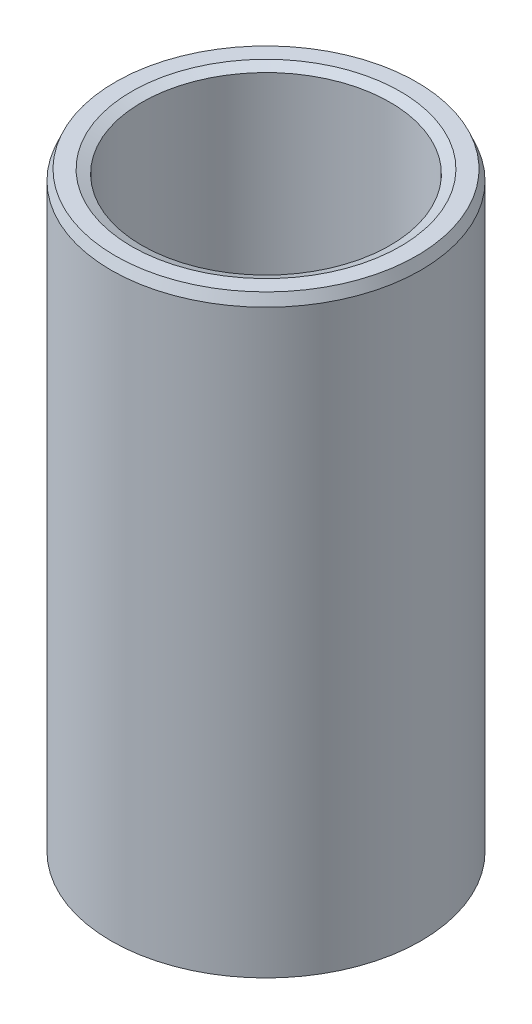
ISO-10303-21;
HEADER;
FILE_DESCRIPTION(('STEP AP214'),'2;1');
FILE_NAME('part.step','',(''),(''),'','','');
FILE_SCHEMA(('AUTOMOTIVE_DESIGN { 1 0 10303 214 1 1 1 1 }'));
ENDSEC;
DATA;
#1=APPLICATION_CONTEXT('core data for automotive mechanical design processes');
#2=APPLICATION_PROTOCOL_DEFINITION('international standard','automotive_design',2000,#1);
#3=PRODUCT_CONTEXT('',#1,'mechanical');
#4=PRODUCT('Part','Part','',(#3));
#5=PRODUCT_RELATED_PRODUCT_CATEGORY('part','',(#4));
#6=PRODUCT_DEFINITION_FORMATION('','',#4);
#7=PRODUCT_DEFINITION_CONTEXT('part definition',#1,'design');
#8=PRODUCT_DEFINITION('design','',#6,#7);
#9=PRODUCT_DEFINITION_SHAPE('','',#8);
#10=(LENGTH_UNIT() NAMED_UNIT(*) SI_UNIT(.MILLI.,.METRE.));
#11=(NAMED_UNIT(*) PLANE_ANGLE_UNIT() SI_UNIT($,.RADIAN.));
#12=(NAMED_UNIT(*) SI_UNIT($,.STERADIAN.) SOLID_ANGLE_UNIT());
#13=UNCERTAINTY_MEASURE_WITH_UNIT(LENGTH_MEASURE(1.E-05),#10,'distance_accuracy_value','');
#14=(GEOMETRIC_REPRESENTATION_CONTEXT(3) GLOBAL_UNCERTAINTY_ASSIGNED_CONTEXT((#13)) GLOBAL_UNIT_ASSIGNED_CONTEXT((#10,
#11,#12)) REPRESENTATION_CONTEXT('',''));
#15=CARTESIAN_POINT('',(0.,0.,0.));
#16=DIRECTION('',(0.,0.,1.));
#17=DIRECTION('',(1.,0.,0.));
#18=AXIS2_PLACEMENT_3D('',#15,#16,#17);
#19=CARTESIAN_POINT('',(0.,201.804179927522,0.));
#20=DIRECTION('',(0.,-1.,0.));
#21=DIRECTION('',(0.,0.,-1.));
#22=AXIS2_PLACEMENT_3D('',#19,#20,#21);
#23=CYLINDRICAL_SURFACE('',#22,52.5);
#24=CARTESIAN_POINT('',(0.,1.44022365997734,0.));
#25=DIRECTION('',(0.,1.,0.));
#26=DIRECTION('',(0.,0.,1.));
#27=AXIS2_PLACEMENT_3D('',#24,#25,#26);
#28=CIRCLE('',#27,52.5);
#29=CARTESIAN_POINT('',(0.,1.44022365997734,52.5));
#30=VERTEX_POINT('',#29);
#31=EDGE_CURVE('E10',#30,#30,#28,.T.);
#32=ORIENTED_EDGE('',*,*,#31,.T.);
#33=EDGE_LOOP('',(#32));
#34=FACE_BOUND('',#33,.T.);
#35=CARTESIAN_POINT('',(0.,198.327570947113,0.));
#36=DIRECTION('',(0.,1.,0.));
#37=DIRECTION('',(0.,0.,1.));
#38=AXIS2_PLACEMENT_3D('',#35,#36,#37);
#39=CIRCLE('',#38,52.5);
#40=CARTESIAN_POINT('',(0.,198.327570947113,52.5));
#41=VERTEX_POINT('',#40);
#42=EDGE_CURVE('E50',#41,#41,#39,.F.);
#43=ORIENTED_EDGE('',*,*,#42,.T.);
#44=EDGE_LOOP('',(#43));
#45=FACE_BOUND('',#44,.T.);
#46=ADVANCED_FACE('F39',(#34,#45),#23,.T.);
#47=CARTESIAN_POINT('',(0.,201.804179927522,0.));
#48=DIRECTION('',(0.,1.,0.));
#49=DIRECTION('',(0.,0.,1.));
#50=AXIS2_PLACEMENT_3D('',#47,#48,#49);
#51=PLANE('',#50);
#52=CARTESIAN_POINT('',(0.,201.804179927522,0.));
#53=DIRECTION('',(0.,1.,0.));
#54=DIRECTION('',(0.,0.,1.));
#55=AXIS2_PLACEMENT_3D('',#52,#53,#54);
#56=CIRCLE('',#55,45.5260832217705);
#57=CARTESIAN_POINT('',(0.,201.804179927522,45.5260832217705));
#58=VERTEX_POINT('',#57);
#59=EDGE_CURVE('E58',#58,#58,#56,.F.);
#60=ORIENTED_EDGE('',*,*,#59,.T.);
#61=EDGE_LOOP('',(#60));
#62=FACE_BOUND('',#61,.T.);
#63=CARTESIAN_POINT('',(0.,201.804179927522,0.));
#64=DIRECTION('',(0.,1.,0.));
#65=DIRECTION('',(0.,0.,1.));
#66=AXIS2_PLACEMENT_3D('',#63,#64,#65);
#67=CIRCLE('',#66,51.0597763400227);
#68=CARTESIAN_POINT('',(0.,201.804179927522,51.0597763400227));
#69=VERTEX_POINT('',#68);
#70=EDGE_CURVE('E61',#69,#69,#67,.T.);
#71=ORIENTED_EDGE('',*,*,#70,.T.);
#72=EDGE_LOOP('',(#71));
#73=FACE_BOUND('',#72,.T.);
#74=ADVANCED_FACE('F88',(#62,#73),#51,.T.);
#75=CARTESIAN_POINT('',(0.,0.,0.));
#76=DIRECTION('',(0.,1.,0.));
#77=DIRECTION('',(0.,0.,1.));
#78=AXIS2_PLACEMENT_3D('',#75,#76,#77);
#79=PLANE('',#78);
#80=CARTESIAN_POINT('',(0.,0.,0.));
#81=DIRECTION('',(0.,1.,0.));
#82=DIRECTION('',(0.,0.,1.));
#83=AXIS2_PLACEMENT_3D('',#80,#81,#82);
#84=CIRCLE('',#83,43.4896979013386);
#85=CARTESIAN_POINT('',(0.,0.,43.4896979013386));
#86=VERTEX_POINT('',#85);
#87=EDGE_CURVE('E51',#86,#86,#84,.T.);
#88=ORIENTED_EDGE('',*,*,#87,.T.);
#89=EDGE_LOOP('',(#88));
#90=FACE_BOUND('',#89,.T.);
#91=CARTESIAN_POINT('',(0.,0.,0.));
#92=DIRECTION('',(0.,1.,0.));
#93=DIRECTION('',(0.,0.,1.));
#94=AXIS2_PLACEMENT_3D('',#91,#92,#93);
#95=CIRCLE('',#94,49.0233910195907);
#96=CARTESIAN_POINT('',(0.,0.,49.0233910195907));
#97=VERTEX_POINT('',#96);
#98=EDGE_CURVE('E54',#97,#97,#95,.F.);
#99=ORIENTED_EDGE('',*,*,#98,.T.);
#100=EDGE_LOOP('',(#99));
#101=FACE_BOUND('',#100,.T.);
#102=ADVANCED_FACE('F83',(#90,#101),#79,.F.);
#103=CARTESIAN_POINT('',(0.,201.804179927522,0.));
#104=DIRECTION('',(0.,-1.,0.));
#105=DIRECTION('',(0.,0.,-1.));
#106=AXIS2_PLACEMENT_3D('',#103,#104,#105);
#107=CYLINDRICAL_SURFACE('',#106,42.0494742413613);
#108=CARTESIAN_POINT('',(0.,200.363956267545,0.));
#109=DIRECTION('',(0.,1.,0.));
#110=DIRECTION('',(0.,0.,1.));
#111=AXIS2_PLACEMENT_3D('',#108,#109,#110);
#112=CIRCLE('',#111,42.0494742413613);
#113=CARTESIAN_POINT('',(0.,200.363956267545,42.0494742413613));
#114=VERTEX_POINT('',#113);
#115=EDGE_CURVE('E67',#114,#114,#112,.T.);
#116=ORIENTED_EDGE('',*,*,#115,.T.);
#117=EDGE_LOOP('',(#116));
#118=FACE_BOUND('',#117,.T.);
#119=CARTESIAN_POINT('',(0.,3.47660898040927,0.));
#120=DIRECTION('',(0.,1.,0.));
#121=DIRECTION('',(0.,0.,1.));
#122=AXIS2_PLACEMENT_3D('',#119,#120,#121);
#123=CIRCLE('',#122,42.0494742413613);
#124=CARTESIAN_POINT('',(0.,3.47660898040927,42.0494742413613));
#125=VERTEX_POINT('',#124);
#126=EDGE_CURVE('E69',#125,#125,#123,.F.);
#127=ORIENTED_EDGE('',*,*,#126,.T.);
#128=EDGE_LOOP('',(#127));
#129=FACE_BOUND('',#128,.T.);
#130=ADVANCED_FACE('F71',(#118,#129),#107,.F.);
#131=CARTESIAN_POINT('',(0.,200.363956267545,0.));
#132=DIRECTION('',(0.,1.,0.));
#133=DIRECTION('',(0.,0.,1.));
#134=AXIS2_PLACEMENT_3D('',#131,#132,#133);
#135=CONICAL_SURFACE('',#134,42.0494742413613,1.1780567191034);
#136=ORIENTED_EDGE('',*,*,#59,.F.);
#137=EDGE_LOOP('',(#136));
#138=FACE_BOUND('',#137,.T.);
#139=ORIENTED_EDGE('',*,*,#115,.F.);
#140=EDGE_LOOP('',(#139));
#141=FACE_BOUND('',#140,.T.);
#142=ADVANCED_FACE('F77',(#138,#141),#135,.F.);
#143=CARTESIAN_POINT('',(0.,0.,0.));
#144=DIRECTION('',(0.,-1.,0.));
#145=DIRECTION('',(0.,0.,-1.));
#146=AXIS2_PLACEMENT_3D('',#143,#144,#145);
#147=CONICAL_SURFACE('',#146,43.4896979013386,0.392739607691482);
#148=ORIENTED_EDGE('',*,*,#126,.F.);
#149=EDGE_LOOP('',(#148));
#150=FACE_BOUND('',#149,.T.);
#151=ORIENTED_EDGE('',*,*,#87,.F.);
#152=EDGE_LOOP('',(#151));
#153=FACE_BOUND('',#152,.T.);
#154=ADVANCED_FACE('F73',(#150,#153),#147,.F.);
#155=CARTESIAN_POINT('',(0.,1.44022365997734,0.));
#156=DIRECTION('',(0.,1.,0.));
#157=DIRECTION('',(0.,0.,1.));
#158=AXIS2_PLACEMENT_3D('',#155,#156,#157);
#159=CONICAL_SURFACE('',#158,52.5,1.17805671910341);
#160=ORIENTED_EDGE('',*,*,#98,.F.);
#161=EDGE_LOOP('',(#160));
#162=FACE_BOUND('',#161,.T.);
#163=ORIENTED_EDGE('',*,*,#31,.F.);
#164=EDGE_LOOP('',(#163));
#165=FACE_BOUND('',#164,.T.);
#166=ADVANCED_FACE('F76',(#162,#165),#159,.T.);
#167=CARTESIAN_POINT('',(0.,201.804179927522,0.));
#168=DIRECTION('',(0.,-1.,0.));
#169=DIRECTION('',(0.,0.,-1.));
#170=AXIS2_PLACEMENT_3D('',#167,#168,#169);
#171=CONICAL_SURFACE('',#170,51.0597763400227,0.392739607691478);
#172=ORIENTED_EDGE('',*,*,#42,.F.);
#173=EDGE_LOOP('',(#172));
#174=FACE_BOUND('',#173,.T.);
#175=ORIENTED_EDGE('',*,*,#70,.F.);
#176=EDGE_LOOP('',(#175));
#177=FACE_BOUND('',#176,.T.);
#178=ADVANCED_FACE('F45',(#174,#177),#171,.T.);
#179=CLOSED_SHELL('',(#46,#74,#102,#130,#142,#154,#166,#178));
#180=MANIFOLD_SOLID_BREP('B2',#179);
#181=ADVANCED_BREP_SHAPE_REPRESENTATION('',(#18,#180),#14);
#182=SHAPE_DEFINITION_REPRESENTATION(#9,#181);
ENDSEC;
END-ISO-10303-21;
